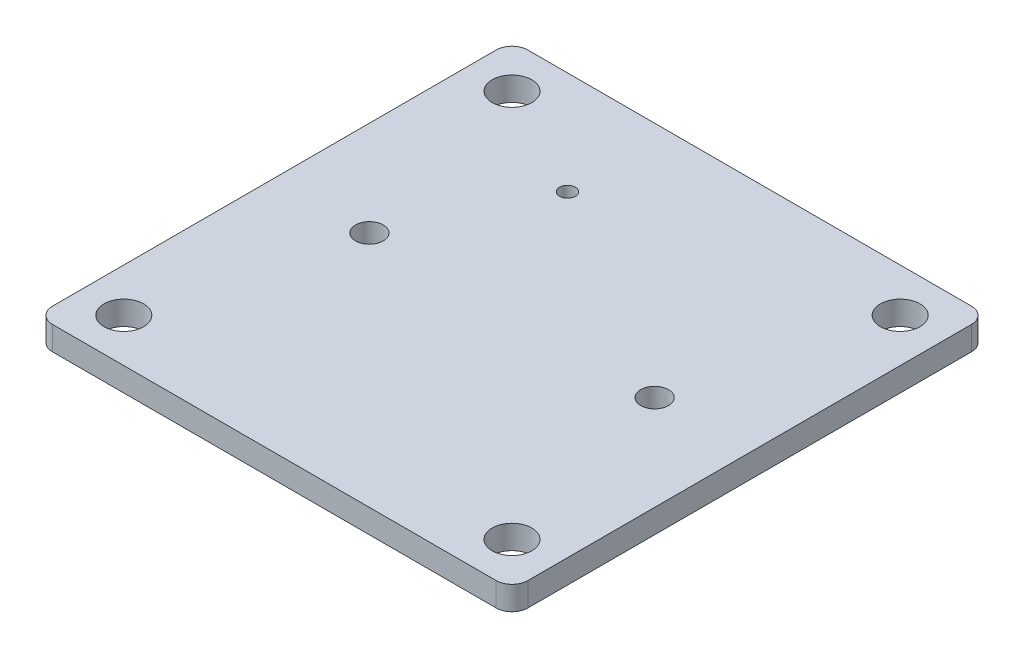
ISO-10303-21;
HEADER;
FILE_DESCRIPTION(('STEP AP214'),'2;1');
FILE_NAME('part.step','',(''),(''),'','','');
FILE_SCHEMA(('AUTOMOTIVE_DESIGN { 1 0 10303 214 1 1 1 1 }'));
ENDSEC;
DATA;
#1=APPLICATION_CONTEXT('core data for automotive mechanical design processes');
#2=APPLICATION_PROTOCOL_DEFINITION('international standard','automotive_design',2000,#1);
#3=PRODUCT_CONTEXT('',#1,'mechanical');
#4=PRODUCT('Part','Part','',(#3));
#5=PRODUCT_RELATED_PRODUCT_CATEGORY('part','',(#4));
#6=PRODUCT_DEFINITION_FORMATION('','',#4);
#7=PRODUCT_DEFINITION_CONTEXT('part definition',#1,'design');
#8=PRODUCT_DEFINITION('design','',#6,#7);
#9=PRODUCT_DEFINITION_SHAPE('','',#8);
#10=(LENGTH_UNIT() NAMED_UNIT(*) SI_UNIT(.MILLI.,.METRE.));
#11=(NAMED_UNIT(*) PLANE_ANGLE_UNIT() SI_UNIT($,.RADIAN.));
#12=(NAMED_UNIT(*) SI_UNIT($,.STERADIAN.) SOLID_ANGLE_UNIT());
#13=UNCERTAINTY_MEASURE_WITH_UNIT(LENGTH_MEASURE(1.E-05),#10,'distance_accuracy_value','');
#14=(GEOMETRIC_REPRESENTATION_CONTEXT(3) GLOBAL_UNCERTAINTY_ASSIGNED_CONTEXT((#13)) GLOBAL_UNIT_ASSIGNED_CONTEXT((#10,
#11,#12)) REPRESENTATION_CONTEXT('',''));
#15=CARTESIAN_POINT('',(0.,0.,0.));
#16=DIRECTION('',(0.,0.,1.));
#17=DIRECTION('',(1.,0.,0.));
#18=AXIS2_PLACEMENT_3D('',#15,#16,#17);
#19=CARTESIAN_POINT('',(0.,1.5,0.));
#20=DIRECTION('',(0.,1.,0.));
#21=DIRECTION('',(0.,0.,1.));
#22=AXIS2_PLACEMENT_3D('',#19,#20,#21);
#23=PLANE('',#22);
#24=CARTESIAN_POINT('',(9.,1.5,0.));
#25=DIRECTION('',(0.,1.,0.));
#26=DIRECTION('',(0.,0.,1.));
#27=AXIS2_PLACEMENT_3D('',#24,#25,#26);
#28=CIRCLE('',#27,0.875);
#29=CARTESIAN_POINT('',(9.,1.5,0.874999999999998));
#30=VERTEX_POINT('',#29);
#31=EDGE_CURVE('E213',#30,#30,#28,.T.);
#32=ORIENTED_EDGE('',*,*,#31,.F.);
#33=EDGE_LOOP('',(#32));
#34=FACE_BOUND('',#33,.T.);
#35=CARTESIAN_POINT('',(-9.,1.5,0.));
#36=DIRECTION('',(0.,1.,0.));
#37=DIRECTION('',(0.,0.,1.));
#38=AXIS2_PLACEMENT_3D('',#35,#36,#37);
#39=CIRCLE('',#38,0.875);
#40=CARTESIAN_POINT('',(-9.,1.5,0.875));
#41=VERTEX_POINT('',#40);
#42=EDGE_CURVE('E207',#41,#41,#39,.T.);
#43=ORIENTED_EDGE('',*,*,#42,.F.);
#44=EDGE_LOOP('',(#43));
#45=FACE_BOUND('',#44,.T.);
#46=CARTESIAN_POINT('',(-5.,1.5,-8.5));
#47=DIRECTION('',(0.,1.,0.));
#48=DIRECTION('',(0.,0.,1.));
#49=AXIS2_PLACEMENT_3D('',#46,#47,#48);
#50=CIRCLE('',#49,0.500000000000001);
#51=CARTESIAN_POINT('',(-5.,1.5,-8.));
#52=VERTEX_POINT('',#51);
#53=EDGE_CURVE('E201',#52,#52,#50,.T.);
#54=ORIENTED_EDGE('',*,*,#53,.F.);
#55=EDGE_LOOP('',(#54));
#56=FACE_BOUND('',#55,.T.);
#57=CARTESIAN_POINT('',(12.25,1.5,12.25));
#58=DIRECTION('',(0.,1.,0.));
#59=DIRECTION('',(0.,0.,1.));
#60=AXIS2_PLACEMENT_3D('',#57,#58,#59);
#61=CIRCLE('',#60,1.25);
#62=CARTESIAN_POINT('',(12.25,1.5,13.5));
#63=VERTEX_POINT('',#62);
#64=EDGE_CURVE('E186',#63,#63,#61,.T.);
#65=ORIENTED_EDGE('',*,*,#64,.F.);
#66=EDGE_LOOP('',(#65));
#67=FACE_BOUND('',#66,.T.);
#68=CARTESIAN_POINT('',(-12.25,1.5,-12.25));
#69=DIRECTION('',(0.,1.,0.));
#70=DIRECTION('',(0.,0.,1.));
#71=AXIS2_PLACEMENT_3D('',#68,#69,#70);
#72=CIRCLE('',#71,1.25);
#73=CARTESIAN_POINT('',(-12.25,1.5,-11.));
#74=VERTEX_POINT('',#73);
#75=EDGE_CURVE('E172',#74,#74,#72,.T.);
#76=ORIENTED_EDGE('',*,*,#75,.F.);
#77=EDGE_LOOP('',(#76));
#78=FACE_BOUND('',#77,.T.);
#79=DIRECTION('',(1.,0.,0.));
#80=VECTOR('',#79,1.);
#81=CARTESIAN_POINT('',(-15.,1.5,15.));
#82=LINE('',#81,#80);
#83=CARTESIAN_POINT('',(-14.,1.5,15.));
#84=VERTEX_POINT('',#83);
#85=CARTESIAN_POINT('',(14.,1.5,15.));
#86=VERTEX_POINT('',#85);
#87=EDGE_CURVE('E167',#84,#86,#82,.T.);
#88=ORIENTED_EDGE('',*,*,#87,.T.);
#89=CARTESIAN_POINT('',(14.,1.5,14.));
#90=DIRECTION('',(0.,1.,0.));
#91=DIRECTION('',(0.,0.,1.));
#92=AXIS2_PLACEMENT_3D('',#89,#90,#91);
#93=CIRCLE('',#92,1.);
#94=CARTESIAN_POINT('',(15.,1.5,14.));
#95=VERTEX_POINT('',#94);
#96=EDGE_CURVE('E148',#86,#95,#93,.T.);
#97=ORIENTED_EDGE('',*,*,#96,.T.);
#98=DIRECTION('',(0.,0.,-1.));
#99=VECTOR('',#98,1.);
#100=CARTESIAN_POINT('',(15.,1.5,-15.));
#101=LINE('',#100,#99);
#102=CARTESIAN_POINT('',(15.,1.5,-14.));
#103=VERTEX_POINT('',#102);
#104=EDGE_CURVE('E118',#95,#103,#101,.T.);
#105=ORIENTED_EDGE('',*,*,#104,.T.);
#106=CARTESIAN_POINT('',(14.,1.5,-14.));
#107=DIRECTION('',(0.,1.,0.));
#108=DIRECTION('',(0.,0.,1.));
#109=AXIS2_PLACEMENT_3D('',#106,#107,#108);
#110=CIRCLE('',#109,1.);
#111=CARTESIAN_POINT('',(14.,1.5,-15.));
#112=VERTEX_POINT('',#111);
#113=EDGE_CURVE('E54',#103,#112,#110,.T.);
#114=ORIENTED_EDGE('',*,*,#113,.T.);
#115=DIRECTION('',(-1.,0.,0.));
#116=VECTOR('',#115,1.);
#117=CARTESIAN_POINT('',(-15.,1.5,-15.));
#118=LINE('',#117,#116);
#119=CARTESIAN_POINT('',(-14.,1.5,-15.));
#120=VERTEX_POINT('',#119);
#121=EDGE_CURVE('E134',#112,#120,#118,.T.);
#122=ORIENTED_EDGE('',*,*,#121,.T.);
#123=CARTESIAN_POINT('',(-14.,1.5,-14.));
#124=DIRECTION('',(0.,1.,0.));
#125=DIRECTION('',(0.,0.,1.));
#126=AXIS2_PLACEMENT_3D('',#123,#124,#125);
#127=CIRCLE('',#126,1.);
#128=CARTESIAN_POINT('',(-15.,1.5,-14.));
#129=VERTEX_POINT('',#128);
#130=EDGE_CURVE('E145',#120,#129,#127,.T.);
#131=ORIENTED_EDGE('',*,*,#130,.T.);
#132=DIRECTION('',(0.,0.,1.));
#133=VECTOR('',#132,1.);
#134=CARTESIAN_POINT('',(-15.,1.5,-15.));
#135=LINE('',#134,#133);
#136=CARTESIAN_POINT('',(-15.,1.5,14.));
#137=VERTEX_POINT('',#136);
#138=EDGE_CURVE('E128',#129,#137,#135,.T.);
#139=ORIENTED_EDGE('',*,*,#138,.T.);
#140=CARTESIAN_POINT('',(-14.,1.5,14.));
#141=DIRECTION('',(0.,1.,0.));
#142=DIRECTION('',(0.,0.,1.));
#143=AXIS2_PLACEMENT_3D('',#140,#141,#142);
#144=CIRCLE('',#143,1.);
#145=EDGE_CURVE('E143',#137,#84,#144,.T.);
#146=ORIENTED_EDGE('',*,*,#145,.T.);
#147=EDGE_LOOP('',(#88,#97,#105,#114,#122,#131,#139,#146));
#148=FACE_BOUND('',#147,.T.);
#149=CARTESIAN_POINT('',(12.25,1.5,-12.25));
#150=DIRECTION('',(0.,1.,0.));
#151=DIRECTION('',(0.,0.,1.));
#152=AXIS2_PLACEMENT_3D('',#149,#150,#151);
#153=CIRCLE('',#152,1.25);
#154=CARTESIAN_POINT('',(12.25,1.5,-11.));
#155=VERTEX_POINT('',#154);
#156=EDGE_CURVE('E181',#155,#155,#153,.T.);
#157=ORIENTED_EDGE('',*,*,#156,.F.);
#158=EDGE_LOOP('',(#157));
#159=FACE_BOUND('',#158,.T.);
#160=CARTESIAN_POINT('',(-12.25,1.5,12.25));
#161=DIRECTION('',(0.,1.,0.));
#162=DIRECTION('',(0.,0.,1.));
#163=AXIS2_PLACEMENT_3D('',#160,#161,#162);
#164=CIRCLE('',#163,1.25);
#165=CARTESIAN_POINT('',(-12.25,1.5,13.5));
#166=VERTEX_POINT('',#165);
#167=EDGE_CURVE('E192',#166,#166,#164,.T.);
#168=ORIENTED_EDGE('',*,*,#167,.F.);
#169=EDGE_LOOP('',(#168));
#170=FACE_BOUND('',#169,.T.);
#171=ADVANCED_FACE('F32',(#34,#45,#56,#67,#78,#148,#159,#170),#23,.T.);
#172=CARTESIAN_POINT('',(0.,0.,0.));
#173=DIRECTION('',(0.,1.,0.));
#174=DIRECTION('',(0.,0.,1.));
#175=AXIS2_PLACEMENT_3D('',#172,#173,#174);
#176=PLANE('',#175);
#177=CARTESIAN_POINT('',(9.,0.,0.));
#178=DIRECTION('',(0.,1.,0.));
#179=DIRECTION('',(0.,0.,1.));
#180=AXIS2_PLACEMENT_3D('',#177,#178,#179);
#181=CIRCLE('',#180,0.875);
#182=CARTESIAN_POINT('',(9.,0.,0.874999999999998));
#183=VERTEX_POINT('',#182);
#184=EDGE_CURVE('E210',#183,#183,#181,.T.);
#185=ORIENTED_EDGE('',*,*,#184,.T.);
#186=EDGE_LOOP('',(#185));
#187=FACE_BOUND('',#186,.T.);
#188=CARTESIAN_POINT('',(-9.,0.,0.));
#189=DIRECTION('',(0.,1.,0.));
#190=DIRECTION('',(0.,0.,1.));
#191=AXIS2_PLACEMENT_3D('',#188,#189,#190);
#192=CIRCLE('',#191,0.875);
#193=CARTESIAN_POINT('',(-9.,0.,0.875));
#194=VERTEX_POINT('',#193);
#195=EDGE_CURVE('E204',#194,#194,#192,.T.);
#196=ORIENTED_EDGE('',*,*,#195,.T.);
#197=EDGE_LOOP('',(#196));
#198=FACE_BOUND('',#197,.T.);
#199=CARTESIAN_POINT('',(-5.,0.,-8.5));
#200=DIRECTION('',(0.,1.,0.));
#201=DIRECTION('',(0.,0.,1.));
#202=AXIS2_PLACEMENT_3D('',#199,#200,#201);
#203=CIRCLE('',#202,0.500000000000001);
#204=CARTESIAN_POINT('',(-5.,0.,-8.));
#205=VERTEX_POINT('',#204);
#206=EDGE_CURVE('E198',#205,#205,#203,.T.);
#207=ORIENTED_EDGE('',*,*,#206,.T.);
#208=EDGE_LOOP('',(#207));
#209=FACE_BOUND('',#208,.T.);
#210=CARTESIAN_POINT('',(12.25,0.,12.25));
#211=DIRECTION('',(0.,1.,0.));
#212=DIRECTION('',(0.,0.,1.));
#213=AXIS2_PLACEMENT_3D('',#210,#211,#212);
#214=CIRCLE('',#213,1.25);
#215=CARTESIAN_POINT('',(12.25,0.,13.5));
#216=VERTEX_POINT('',#215);
#217=EDGE_CURVE('E189',#216,#216,#214,.T.);
#218=ORIENTED_EDGE('',*,*,#217,.T.);
#219=EDGE_LOOP('',(#218));
#220=FACE_BOUND('',#219,.T.);
#221=CARTESIAN_POINT('',(-12.25,0.,-12.25));
#222=DIRECTION('',(0.,1.,0.));
#223=DIRECTION('',(0.,0.,1.));
#224=AXIS2_PLACEMENT_3D('',#221,#222,#223);
#225=CIRCLE('',#224,1.25);
#226=CARTESIAN_POINT('',(-12.25,0.,-11.));
#227=VERTEX_POINT('',#226);
#228=EDGE_CURVE('E174',#227,#227,#225,.T.);
#229=ORIENTED_EDGE('',*,*,#228,.T.);
#230=EDGE_LOOP('',(#229));
#231=FACE_BOUND('',#230,.T.);
#232=DIRECTION('',(0.,0.,-1.));
#233=VECTOR('',#232,1.);
#234=CARTESIAN_POINT('',(15.,0.,-15.));
#235=LINE('',#234,#233);
#236=CARTESIAN_POINT('',(15.,0.,14.));
#237=VERTEX_POINT('',#236);
#238=CARTESIAN_POINT('',(15.,0.,-14.));
#239=VERTEX_POINT('',#238);
#240=EDGE_CURVE('E116',#237,#239,#235,.T.);
#241=ORIENTED_EDGE('',*,*,#240,.F.);
#242=CARTESIAN_POINT('',(14.,0.,14.));
#243=DIRECTION('',(0.,1.,0.));
#244=DIRECTION('',(0.,0.,1.));
#245=AXIS2_PLACEMENT_3D('',#242,#243,#244);
#246=CIRCLE('',#245,1.);
#247=CARTESIAN_POINT('',(14.,0.,15.));
#248=VERTEX_POINT('',#247);
#249=EDGE_CURVE('E99',#237,#248,#246,.F.);
#250=ORIENTED_EDGE('',*,*,#249,.T.);
#251=DIRECTION('',(1.,0.,0.));
#252=VECTOR('',#251,1.);
#253=CARTESIAN_POINT('',(-15.,0.,15.));
#254=LINE('',#253,#252);
#255=CARTESIAN_POINT('',(-14.,0.,15.));
#256=VERTEX_POINT('',#255);
#257=EDGE_CURVE('E126',#256,#248,#254,.T.);
#258=ORIENTED_EDGE('',*,*,#257,.F.);
#259=CARTESIAN_POINT('',(-14.,0.,14.));
#260=DIRECTION('',(0.,1.,0.));
#261=DIRECTION('',(0.,0.,1.));
#262=AXIS2_PLACEMENT_3D('',#259,#260,#261);
#263=CIRCLE('',#262,1.);
#264=CARTESIAN_POINT('',(-15.,0.,14.));
#265=VERTEX_POINT('',#264);
#266=EDGE_CURVE('E119',#256,#265,#263,.F.);
#267=ORIENTED_EDGE('',*,*,#266,.T.);
#268=DIRECTION('',(0.,0.,1.));
#269=VECTOR('',#268,1.);
#270=CARTESIAN_POINT('',(-15.,0.,-15.));
#271=LINE('',#270,#269);
#272=CARTESIAN_POINT('',(-15.,0.,-14.));
#273=VERTEX_POINT('',#272);
#274=EDGE_CURVE('E130',#273,#265,#271,.T.);
#275=ORIENTED_EDGE('',*,*,#274,.F.);
#276=CARTESIAN_POINT('',(-14.,0.,-14.));
#277=DIRECTION('',(0.,1.,0.));
#278=DIRECTION('',(0.,0.,1.));
#279=AXIS2_PLACEMENT_3D('',#276,#277,#278);
#280=CIRCLE('',#279,1.);
#281=CARTESIAN_POINT('',(-14.,0.,-15.));
#282=VERTEX_POINT('',#281);
#283=EDGE_CURVE('E137',#273,#282,#280,.F.);
#284=ORIENTED_EDGE('',*,*,#283,.T.);
#285=DIRECTION('',(-1.,0.,0.));
#286=VECTOR('',#285,1.);
#287=CARTESIAN_POINT('',(-15.,0.,-15.));
#288=LINE('',#287,#286);
#289=CARTESIAN_POINT('',(14.,0.,-15.));
#290=VERTEX_POINT('',#289);
#291=EDGE_CURVE('E125',#290,#282,#288,.T.);
#292=ORIENTED_EDGE('',*,*,#291,.F.);
#293=CARTESIAN_POINT('',(14.,0.,-14.));
#294=DIRECTION('',(0.,1.,0.));
#295=DIRECTION('',(0.,0.,1.));
#296=AXIS2_PLACEMENT_3D('',#293,#294,#295);
#297=CIRCLE('',#296,1.);
#298=EDGE_CURVE('E110',#290,#239,#297,.F.);
#299=ORIENTED_EDGE('',*,*,#298,.T.);
#300=EDGE_LOOP('',(#241,#250,#258,#267,#275,#284,#292,#299));
#301=FACE_BOUND('',#300,.T.);
#302=CARTESIAN_POINT('',(12.25,0.,-12.25));
#303=DIRECTION('',(0.,1.,0.));
#304=DIRECTION('',(0.,0.,1.));
#305=AXIS2_PLACEMENT_3D('',#302,#303,#304);
#306=CIRCLE('',#305,1.25);
#307=CARTESIAN_POINT('',(12.25,0.,-11.));
#308=VERTEX_POINT('',#307);
#309=EDGE_CURVE('E183',#308,#308,#306,.T.);
#310=ORIENTED_EDGE('',*,*,#309,.T.);
#311=EDGE_LOOP('',(#310));
#312=FACE_BOUND('',#311,.T.);
#313=CARTESIAN_POINT('',(-12.25,0.,12.25));
#314=DIRECTION('',(0.,1.,0.));
#315=DIRECTION('',(0.,0.,1.));
#316=AXIS2_PLACEMENT_3D('',#313,#314,#315);
#317=CIRCLE('',#316,1.25);
#318=CARTESIAN_POINT('',(-12.25,0.,13.5));
#319=VERTEX_POINT('',#318);
#320=EDGE_CURVE('E195',#319,#319,#317,.T.);
#321=ORIENTED_EDGE('',*,*,#320,.T.);
#322=EDGE_LOOP('',(#321));
#323=FACE_BOUND('',#322,.T.);
#324=ADVANCED_FACE('F122',(#187,#198,#209,#220,#231,#301,#312,#323),#176,.F.);
#325=CARTESIAN_POINT('',(-15.,1.5,-15.));
#326=DIRECTION('',(1.,0.,0.));
#327=DIRECTION('',(0.,0.,-1.));
#328=AXIS2_PLACEMENT_3D('',#325,#326,#327);
#329=PLANE('',#328);
#330=ORIENTED_EDGE('',*,*,#138,.F.);
#331=DIRECTION('',(0.,-1.,0.));
#332=VECTOR('',#331,1.);
#333=CARTESIAN_POINT('',(-15.,1.5,-14.));
#334=LINE('',#333,#332);
#335=EDGE_CURVE('E11',#129,#273,#334,.T.);
#336=ORIENTED_EDGE('',*,*,#335,.T.);
#337=ORIENTED_EDGE('',*,*,#274,.T.);
#338=DIRECTION('',(0.,-1.,0.));
#339=VECTOR('',#338,1.);
#340=CARTESIAN_POINT('',(-15.,1.5,14.));
#341=LINE('',#340,#339);
#342=EDGE_CURVE('E40',#265,#137,#341,.F.);
#343=ORIENTED_EDGE('',*,*,#342,.T.);
#344=EDGE_LOOP('',(#330,#336,#337,#343));
#345=FACE_BOUND('',#344,.T.);
#346=ADVANCED_FACE('F158',(#345),#329,.F.);
#347=CARTESIAN_POINT('',(-15.,1.5,15.));
#348=DIRECTION('',(0.,0.,-1.));
#349=DIRECTION('',(-1.,0.,0.));
#350=AXIS2_PLACEMENT_3D('',#347,#348,#349);
#351=PLANE('',#350);
#352=ORIENTED_EDGE('',*,*,#257,.T.);
#353=DIRECTION('',(0.,-1.,0.));
#354=VECTOR('',#353,1.);
#355=CARTESIAN_POINT('',(14.,1.5,15.));
#356=LINE('',#355,#354);
#357=EDGE_CURVE('E104',#248,#86,#356,.F.);
#358=ORIENTED_EDGE('',*,*,#357,.T.);
#359=ORIENTED_EDGE('',*,*,#87,.F.);
#360=DIRECTION('',(0.,-1.,0.));
#361=VECTOR('',#360,1.);
#362=CARTESIAN_POINT('',(-14.,1.5,15.));
#363=LINE('',#362,#361);
#364=EDGE_CURVE('E109',#84,#256,#363,.T.);
#365=ORIENTED_EDGE('',*,*,#364,.T.);
#366=EDGE_LOOP('',(#352,#358,#359,#365));
#367=FACE_BOUND('',#366,.T.);
#368=ADVANCED_FACE('F171',(#367),#351,.F.);
#369=CARTESIAN_POINT('',(15.,1.5,-15.));
#370=DIRECTION('',(-1.,0.,0.));
#371=DIRECTION('',(0.,0.,1.));
#372=AXIS2_PLACEMENT_3D('',#369,#370,#371);
#373=PLANE('',#372);
#374=ORIENTED_EDGE('',*,*,#104,.F.);
#375=DIRECTION('',(0.,-1.,0.));
#376=VECTOR('',#375,1.);
#377=CARTESIAN_POINT('',(15.,1.5,14.));
#378=LINE('',#377,#376);
#379=EDGE_CURVE('E103',#95,#237,#378,.T.);
#380=ORIENTED_EDGE('',*,*,#379,.T.);
#381=ORIENTED_EDGE('',*,*,#240,.T.);
#382=DIRECTION('',(0.,-1.,0.));
#383=VECTOR('',#382,1.);
#384=CARTESIAN_POINT('',(15.,1.5,-14.));
#385=LINE('',#384,#383);
#386=EDGE_CURVE('E120',#239,#103,#385,.F.);
#387=ORIENTED_EDGE('',*,*,#386,.T.);
#388=EDGE_LOOP('',(#374,#380,#381,#387));
#389=FACE_BOUND('',#388,.T.);
#390=ADVANCED_FACE('F115',(#389),#373,.F.);
#391=CARTESIAN_POINT('',(-15.,1.5,-15.));
#392=DIRECTION('',(0.,0.,1.));
#393=DIRECTION('',(1.,0.,0.));
#394=AXIS2_PLACEMENT_3D('',#391,#392,#393);
#395=PLANE('',#394);
#396=ORIENTED_EDGE('',*,*,#121,.F.);
#397=DIRECTION('',(0.,-1.,0.));
#398=VECTOR('',#397,1.);
#399=CARTESIAN_POINT('',(14.,1.5,-15.));
#400=LINE('',#399,#398);
#401=EDGE_CURVE('E151',#112,#290,#400,.T.);
#402=ORIENTED_EDGE('',*,*,#401,.T.);
#403=ORIENTED_EDGE('',*,*,#291,.T.);
#404=DIRECTION('',(0.,-1.,0.));
#405=VECTOR('',#404,1.);
#406=CARTESIAN_POINT('',(-14.,1.5,-15.));
#407=LINE('',#406,#405);
#408=EDGE_CURVE('E47',#282,#120,#407,.F.);
#409=ORIENTED_EDGE('',*,*,#408,.T.);
#410=EDGE_LOOP('',(#396,#402,#403,#409));
#411=FACE_BOUND('',#410,.T.);
#412=ADVANCED_FACE('F243',(#411),#395,.F.);
#413=CARTESIAN_POINT('',(-12.25,1.5,-12.25));
#414=DIRECTION('',(0.,-1.,0.));
#415=DIRECTION('',(0.,0.,-1.));
#416=AXIS2_PLACEMENT_3D('',#413,#414,#415);
#417=CYLINDRICAL_SURFACE('',#416,1.25);
#418=ORIENTED_EDGE('',*,*,#75,.T.);
#419=EDGE_LOOP('',(#418));
#420=FACE_BOUND('',#419,.T.);
#421=ORIENTED_EDGE('',*,*,#228,.F.);
#422=EDGE_LOOP('',(#421));
#423=FACE_BOUND('',#422,.T.);
#424=ADVANCED_FACE('F239',(#420,#423),#417,.F.);
#425=CARTESIAN_POINT('',(12.25,1.5,-12.25));
#426=DIRECTION('',(0.,-1.,0.));
#427=DIRECTION('',(0.,0.,-1.));
#428=AXIS2_PLACEMENT_3D('',#425,#426,#427);
#429=CYLINDRICAL_SURFACE('',#428,1.25);
#430=ORIENTED_EDGE('',*,*,#156,.T.);
#431=EDGE_LOOP('',(#430));
#432=FACE_BOUND('',#431,.T.);
#433=ORIENTED_EDGE('',*,*,#309,.F.);
#434=EDGE_LOOP('',(#433));
#435=FACE_BOUND('',#434,.T.);
#436=ADVANCED_FACE('F242',(#432,#435),#429,.F.);
#437=CARTESIAN_POINT('',(12.25,1.5,12.25));
#438=DIRECTION('',(0.,-1.,0.));
#439=DIRECTION('',(0.,0.,-1.));
#440=AXIS2_PLACEMENT_3D('',#437,#438,#439);
#441=CYLINDRICAL_SURFACE('',#440,1.25);
#442=ORIENTED_EDGE('',*,*,#64,.T.);
#443=EDGE_LOOP('',(#442));
#444=FACE_BOUND('',#443,.T.);
#445=ORIENTED_EDGE('',*,*,#217,.F.);
#446=EDGE_LOOP('',(#445));
#447=FACE_BOUND('',#446,.T.);
#448=ADVANCED_FACE('F288',(#444,#447),#441,.F.);
#449=CARTESIAN_POINT('',(-12.25,1.5,12.25));
#450=DIRECTION('',(0.,-1.,0.));
#451=DIRECTION('',(0.,0.,-1.));
#452=AXIS2_PLACEMENT_3D('',#449,#450,#451);
#453=CYLINDRICAL_SURFACE('',#452,1.25);
#454=ORIENTED_EDGE('',*,*,#167,.T.);
#455=EDGE_LOOP('',(#454));
#456=FACE_BOUND('',#455,.T.);
#457=ORIENTED_EDGE('',*,*,#320,.F.);
#458=EDGE_LOOP('',(#457));
#459=FACE_BOUND('',#458,.T.);
#460=ADVANCED_FACE('F263',(#456,#459),#453,.F.);
#461=CARTESIAN_POINT('',(14.,1.5,14.));
#462=DIRECTION('',(0.,-1.,0.));
#463=DIRECTION('',(0.,0.,-1.));
#464=AXIS2_PLACEMENT_3D('',#461,#462,#463);
#465=CYLINDRICAL_SURFACE('',#464,1.);
#466=ORIENTED_EDGE('',*,*,#96,.F.);
#467=ORIENTED_EDGE('',*,*,#357,.F.);
#468=ORIENTED_EDGE('',*,*,#249,.F.);
#469=ORIENTED_EDGE('',*,*,#379,.F.);
#470=EDGE_LOOP('',(#466,#467,#468,#469));
#471=FACE_BOUND('',#470,.T.);
#472=ADVANCED_FACE('F102',(#471),#465,.T.);
#473=CARTESIAN_POINT('',(14.,1.5,-14.));
#474=DIRECTION('',(0.,-1.,0.));
#475=DIRECTION('',(0.,0.,-1.));
#476=AXIS2_PLACEMENT_3D('',#473,#474,#475);
#477=CYLINDRICAL_SURFACE('',#476,1.);
#478=ORIENTED_EDGE('',*,*,#113,.F.);
#479=ORIENTED_EDGE('',*,*,#386,.F.);
#480=ORIENTED_EDGE('',*,*,#298,.F.);
#481=ORIENTED_EDGE('',*,*,#401,.F.);
#482=EDGE_LOOP('',(#478,#479,#480,#481));
#483=FACE_BOUND('',#482,.T.);
#484=ADVANCED_FACE('F262',(#483),#477,.T.);
#485=CARTESIAN_POINT('',(-14.,1.5,-14.));
#486=DIRECTION('',(0.,-1.,0.));
#487=DIRECTION('',(0.,0.,-1.));
#488=AXIS2_PLACEMENT_3D('',#485,#486,#487);
#489=CYLINDRICAL_SURFACE('',#488,1.);
#490=ORIENTED_EDGE('',*,*,#130,.F.);
#491=ORIENTED_EDGE('',*,*,#408,.F.);
#492=ORIENTED_EDGE('',*,*,#283,.F.);
#493=ORIENTED_EDGE('',*,*,#335,.F.);
#494=EDGE_LOOP('',(#490,#491,#492,#493));
#495=FACE_BOUND('',#494,.T.);
#496=ADVANCED_FACE('F265',(#495),#489,.T.);
#497=CARTESIAN_POINT('',(-14.,1.5,14.));
#498=DIRECTION('',(0.,-1.,0.));
#499=DIRECTION('',(0.,0.,-1.));
#500=AXIS2_PLACEMENT_3D('',#497,#498,#499);
#501=CYLINDRICAL_SURFACE('',#500,1.);
#502=ORIENTED_EDGE('',*,*,#145,.F.);
#503=ORIENTED_EDGE('',*,*,#342,.F.);
#504=ORIENTED_EDGE('',*,*,#266,.F.);
#505=ORIENTED_EDGE('',*,*,#364,.F.);
#506=EDGE_LOOP('',(#502,#503,#504,#505));
#507=FACE_BOUND('',#506,.T.);
#508=ADVANCED_FACE('F34',(#507),#501,.T.);
#509=CARTESIAN_POINT('',(-5.,0.,-8.5));
#510=DIRECTION('',(0.,1.,0.));
#511=DIRECTION('',(0.,0.,1.));
#512=AXIS2_PLACEMENT_3D('',#509,#510,#511);
#513=CYLINDRICAL_SURFACE('',#512,0.500000000000001);
#514=ORIENTED_EDGE('',*,*,#206,.F.);
#515=EDGE_LOOP('',(#514));
#516=FACE_BOUND('',#515,.T.);
#517=ORIENTED_EDGE('',*,*,#53,.T.);
#518=EDGE_LOOP('',(#517));
#519=FACE_BOUND('',#518,.T.);
#520=ADVANCED_FACE('F272',(#516,#519),#513,.F.);
#521=CARTESIAN_POINT('',(-9.,0.,0.));
#522=DIRECTION('',(0.,1.,0.));
#523=DIRECTION('',(0.,0.,1.));
#524=AXIS2_PLACEMENT_3D('',#521,#522,#523);
#525=CYLINDRICAL_SURFACE('',#524,0.875);
#526=ORIENTED_EDGE('',*,*,#195,.F.);
#527=EDGE_LOOP('',(#526));
#528=FACE_BOUND('',#527,.T.);
#529=ORIENTED_EDGE('',*,*,#42,.T.);
#530=EDGE_LOOP('',(#529));
#531=FACE_BOUND('',#530,.T.);
#532=ADVANCED_FACE('F224',(#528,#531),#525,.F.);
#533=CARTESIAN_POINT('',(9.,0.,0.));
#534=DIRECTION('',(0.,1.,0.));
#535=DIRECTION('',(0.,0.,1.));
#536=AXIS2_PLACEMENT_3D('',#533,#534,#535);
#537=CYLINDRICAL_SURFACE('',#536,0.875);
#538=ORIENTED_EDGE('',*,*,#184,.F.);
#539=EDGE_LOOP('',(#538));
#540=FACE_BOUND('',#539,.T.);
#541=ORIENTED_EDGE('',*,*,#31,.T.);
#542=EDGE_LOOP('',(#541));
#543=FACE_BOUND('',#542,.T.);
#544=ADVANCED_FACE('F221',(#540,#543),#537,.F.);
#545=CLOSED_SHELL('',(#171,#324,#346,#368,#390,#412,#424,#436,#448,#460,#472,#484,#496,#508,
#520,#532,#544));
#546=MANIFOLD_SOLID_BREP('B2',#545);
#547=ADVANCED_BREP_SHAPE_REPRESENTATION('',(#18,#546),#14);
#548=SHAPE_DEFINITION_REPRESENTATION(#9,#547);
ENDSEC;
END-ISO-10303-21;
